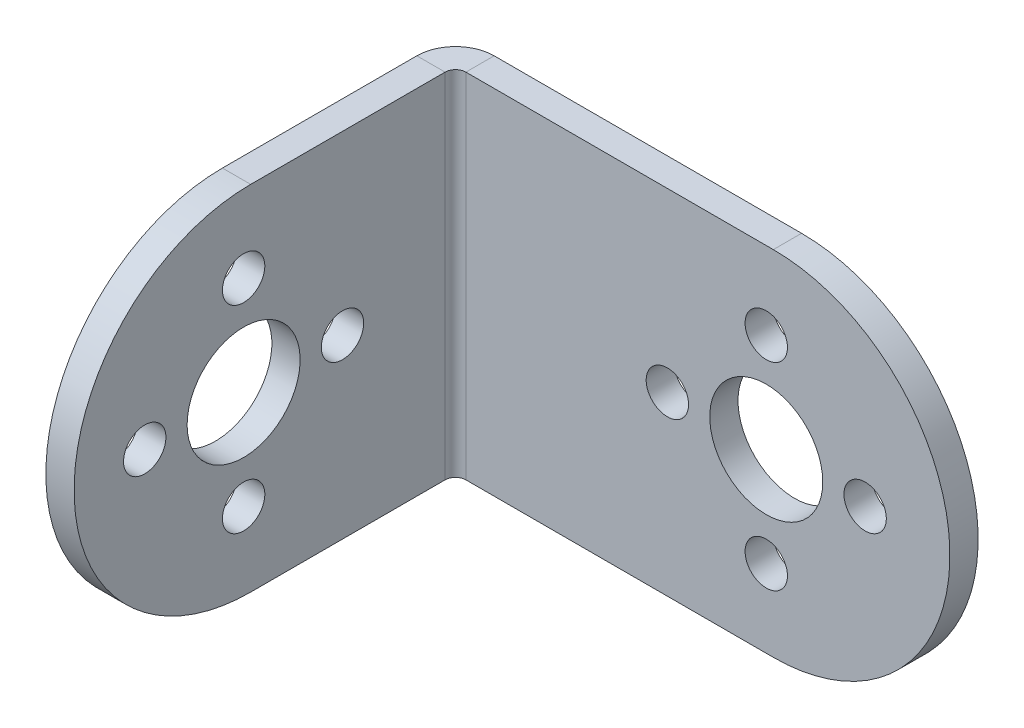
ISO-10303-21;
HEADER;
FILE_DESCRIPTION(('STEP AP214'),'2;1');
FILE_NAME('part.step','',(''),(''),'','','');
FILE_SCHEMA(('AUTOMOTIVE_DESIGN { 1 0 10303 214 1 1 1 1 }'));
ENDSEC;
DATA;
#1=APPLICATION_CONTEXT('core data for automotive mechanical design processes');
#2=APPLICATION_PROTOCOL_DEFINITION('international standard','automotive_design',2000,#1);
#3=PRODUCT_CONTEXT('',#1,'mechanical');
#4=PRODUCT('Part','Part','',(#3));
#5=PRODUCT_RELATED_PRODUCT_CATEGORY('part','',(#4));
#6=PRODUCT_DEFINITION_FORMATION('','',#4);
#7=PRODUCT_DEFINITION_CONTEXT('part definition',#1,'design');
#8=PRODUCT_DEFINITION('design','',#6,#7);
#9=PRODUCT_DEFINITION_SHAPE('','',#8);
#10=(LENGTH_UNIT() NAMED_UNIT(*) SI_UNIT(.MILLI.,.METRE.));
#11=(NAMED_UNIT(*) PLANE_ANGLE_UNIT() SI_UNIT($,.RADIAN.));
#12=(NAMED_UNIT(*) SI_UNIT($,.STERADIAN.) SOLID_ANGLE_UNIT());
#13=UNCERTAINTY_MEASURE_WITH_UNIT(LENGTH_MEASURE(1.E-05),#10,'distance_accuracy_value','');
#14=(GEOMETRIC_REPRESENTATION_CONTEXT(3) GLOBAL_UNCERTAINTY_ASSIGNED_CONTEXT((#13)) GLOBAL_UNIT_ASSIGNED_CONTEXT((#10,
#11,#12)) REPRESENTATION_CONTEXT('',''));
#15=CARTESIAN_POINT('',(0.,0.,0.));
#16=DIRECTION('',(0.,0.,1.));
#17=DIRECTION('',(1.,0.,0.));
#18=AXIS2_PLACEMENT_3D('',#15,#16,#17);
#19=CARTESIAN_POINT('',(0.,0.,0.));
#20=DIRECTION('',(-1.,0.,0.));
#21=DIRECTION('',(0.,0.,1.));
#22=AXIS2_PLACEMENT_3D('',#19,#20,#21);
#23=PLANE('',#22);
#24=CARTESIAN_POINT('',(0.,-5.5,15.));
#25=DIRECTION('',(-1.,0.,0.));
#26=DIRECTION('',(0.,0.,1.));
#27=AXIS2_PLACEMENT_3D('',#24,#25,#26);
#28=CIRCLE('',#27,1.5);
#29=CARTESIAN_POINT('',(0.,-5.5,16.5));
#30=VERTEX_POINT('',#29);
#31=EDGE_CURVE('E140',#30,#30,#28,.T.);
#32=ORIENTED_EDGE('',*,*,#31,.F.);
#33=EDGE_LOOP('',(#32));
#34=FACE_BOUND('',#33,.T.);
#35=CARTESIAN_POINT('',(0.,-12.5,7.99999999999999));
#36=DIRECTION('',(-1.,0.,0.));
#37=DIRECTION('',(0.,0.,1.));
#38=AXIS2_PLACEMENT_3D('',#35,#36,#37);
#39=CIRCLE('',#38,1.5);
#40=CARTESIAN_POINT('',(0.,-12.5,9.49999999999999));
#41=VERTEX_POINT('',#40);
#42=EDGE_CURVE('E439',#41,#41,#39,.T.);
#43=ORIENTED_EDGE('',*,*,#42,.F.);
#44=EDGE_LOOP('',(#43));
#45=FACE_BOUND('',#44,.T.);
#46=CARTESIAN_POINT('',(0.,-12.5,15.));
#47=DIRECTION('',(-1.,0.,0.));
#48=DIRECTION('',(0.,0.,1.));
#49=AXIS2_PLACEMENT_3D('',#46,#47,#48);
#50=CIRCLE('',#49,4.);
#51=CARTESIAN_POINT('',(0.,-12.5,19.));
#52=VERTEX_POINT('',#51);
#53=EDGE_CURVE('E152',#52,#52,#50,.T.);
#54=ORIENTED_EDGE('',*,*,#53,.F.);
#55=EDGE_LOOP('',(#54));
#56=FACE_BOUND('',#55,.T.);
#57=CARTESIAN_POINT('',(0.,-12.5,22.));
#58=DIRECTION('',(-1.,0.,0.));
#59=DIRECTION('',(0.,0.,1.));
#60=AXIS2_PLACEMENT_3D('',#57,#58,#59);
#61=CIRCLE('',#60,1.5);
#62=CARTESIAN_POINT('',(0.,-12.5,23.5));
#63=VERTEX_POINT('',#62);
#64=EDGE_CURVE('E445',#63,#63,#61,.T.);
#65=ORIENTED_EDGE('',*,*,#64,.F.);
#66=EDGE_LOOP('',(#65));
#67=FACE_BOUND('',#66,.T.);
#68=CARTESIAN_POINT('',(0.,-19.5,15.));
#69=DIRECTION('',(-1.,0.,0.));
#70=DIRECTION('',(0.,0.,1.));
#71=AXIS2_PLACEMENT_3D('',#68,#69,#70);
#72=CIRCLE('',#71,1.5);
#73=CARTESIAN_POINT('',(0.,-19.5,16.5));
#74=VERTEX_POINT('',#73);
#75=EDGE_CURVE('E432',#74,#74,#72,.T.);
#76=ORIENTED_EDGE('',*,*,#75,.F.);
#77=EDGE_LOOP('',(#76));
#78=FACE_BOUND('',#77,.T.);
#79=DIRECTION('',(0.,0.,-1.));
#80=VECTOR('',#79,1.);
#81=CARTESIAN_POINT('',(0.,-25.,0.));
#82=LINE('',#81,#80);
#83=CARTESIAN_POINT('',(0.,-25.,14.5));
#84=VERTEX_POINT('',#83);
#85=CARTESIAN_POINT('',(0.,-25.,0.73659999999999));
#86=VERTEX_POINT('',#85);
#87=EDGE_CURVE('E137',#84,#86,#82,.T.);
#88=ORIENTED_EDGE('',*,*,#87,.F.);
#89=CARTESIAN_POINT('',(0.,-12.5,14.5));
#90=DIRECTION('',(-1.,0.,0.));
#91=DIRECTION('',(0.,0.,1.));
#92=AXIS2_PLACEMENT_3D('',#89,#90,#91);
#93=CIRCLE('',#92,12.5);
#94=CARTESIAN_POINT('',(0.,0.,14.5));
#95=VERTEX_POINT('',#94);
#96=EDGE_CURVE('E123',#95,#84,#93,.F.);
#97=ORIENTED_EDGE('',*,*,#96,.F.);
#98=DIRECTION('',(0.,0.,1.));
#99=VECTOR('',#98,1.);
#100=CARTESIAN_POINT('',(0.,0.,28.));
#101=LINE('',#100,#99);
#102=CARTESIAN_POINT('',(0.,0.,0.73659999999999));
#103=VERTEX_POINT('',#102);
#104=EDGE_CURVE('E145',#103,#95,#101,.T.);
#105=ORIENTED_EDGE('',*,*,#104,.F.);
#106=DIRECTION('',(0.,-1.,0.));
#107=VECTOR('',#106,1.);
#108=CARTESIAN_POINT('',(0.,0.,0.73659999999999));
#109=LINE('',#108,#107);
#110=EDGE_CURVE('E143',#103,#86,#109,.T.);
#111=ORIENTED_EDGE('',*,*,#110,.T.);
#112=EDGE_LOOP('',(#88,#97,#105,#111));
#113=FACE_BOUND('',#112,.T.);
#114=ADVANCED_FACE('F61',(#34,#45,#56,#67,#78,#113),#23,.T.);
#115=CARTESIAN_POINT('',(2.,0.,0.));
#116=DIRECTION('',(-1.,0.,0.));
#117=DIRECTION('',(0.,0.,1.));
#118=AXIS2_PLACEMENT_3D('',#115,#116,#117);
#119=PLANE('',#118);
#120=CARTESIAN_POINT('',(1.99999999999995,-5.5,15.));
#121=DIRECTION('',(-1.,0.,0.));
#122=DIRECTION('',(0.,0.,1.));
#123=AXIS2_PLACEMENT_3D('',#120,#121,#122);
#124=CIRCLE('',#123,1.5);
#125=CARTESIAN_POINT('',(1.99999999999994,-5.5,16.5));
#126=VERTEX_POINT('',#125);
#127=EDGE_CURVE('E429',#126,#126,#124,.T.);
#128=ORIENTED_EDGE('',*,*,#127,.T.);
#129=EDGE_LOOP('',(#128));
#130=FACE_BOUND('',#129,.T.);
#131=CARTESIAN_POINT('',(1.99999999999997,-12.5,8.));
#132=DIRECTION('',(-1.,0.,0.));
#133=DIRECTION('',(0.,0.,1.));
#134=AXIS2_PLACEMENT_3D('',#131,#132,#133);
#135=CIRCLE('',#134,1.5);
#136=CARTESIAN_POINT('',(1.99999999999997,-12.5,9.5));
#137=VERTEX_POINT('',#136);
#138=EDGE_CURVE('E442',#137,#137,#135,.T.);
#139=ORIENTED_EDGE('',*,*,#138,.T.);
#140=EDGE_LOOP('',(#139));
#141=FACE_BOUND('',#140,.T.);
#142=CARTESIAN_POINT('',(1.99999999999995,-12.5,15.));
#143=DIRECTION('',(-1.,0.,0.));
#144=DIRECTION('',(0.,0.,1.));
#145=AXIS2_PLACEMENT_3D('',#142,#143,#144);
#146=CIRCLE('',#145,4.);
#147=CARTESIAN_POINT('',(1.99999999999993,-12.5,19.));
#148=VERTEX_POINT('',#147);
#149=EDGE_CURVE('E169',#148,#148,#146,.T.);
#150=ORIENTED_EDGE('',*,*,#149,.T.);
#151=EDGE_LOOP('',(#150));
#152=FACE_BOUND('',#151,.T.);
#153=CARTESIAN_POINT('',(1.99999999999992,-12.5,22.));
#154=DIRECTION('',(-1.,0.,0.));
#155=DIRECTION('',(0.,0.,1.));
#156=AXIS2_PLACEMENT_3D('',#153,#154,#155);
#157=CIRCLE('',#156,1.5);
#158=CARTESIAN_POINT('',(1.99999999999992,-12.5,23.5));
#159=VERTEX_POINT('',#158);
#160=EDGE_CURVE('E448',#159,#159,#157,.T.);
#161=ORIENTED_EDGE('',*,*,#160,.T.);
#162=EDGE_LOOP('',(#161));
#163=FACE_BOUND('',#162,.T.);
#164=CARTESIAN_POINT('',(1.99999999999995,-19.5,15.));
#165=DIRECTION('',(-1.,0.,0.));
#166=DIRECTION('',(0.,0.,1.));
#167=AXIS2_PLACEMENT_3D('',#164,#165,#166);
#168=CIRCLE('',#167,1.5);
#169=CARTESIAN_POINT('',(1.99999999999994,-19.5,16.5));
#170=VERTEX_POINT('',#169);
#171=EDGE_CURVE('E436',#170,#170,#168,.T.);
#172=ORIENTED_EDGE('',*,*,#171,.T.);
#173=EDGE_LOOP('',(#172));
#174=FACE_BOUND('',#173,.T.);
#175=CARTESIAN_POINT('',(1.99999999999995,-12.5,14.5));
#176=DIRECTION('',(-1.,0.,0.));
#177=DIRECTION('',(0.,0.,1.));
#178=AXIS2_PLACEMENT_3D('',#175,#176,#177);
#179=CIRCLE('',#178,12.5);
#180=CARTESIAN_POINT('',(1.99999999999995,0.,14.5));
#181=VERTEX_POINT('',#180);
#182=CARTESIAN_POINT('',(1.99999999999995,-25.,14.5));
#183=VERTEX_POINT('',#182);
#184=EDGE_CURVE('E76',#181,#183,#179,.F.);
#185=ORIENTED_EDGE('',*,*,#184,.T.);
#186=DIRECTION('',(0.,0.,1.));
#187=VECTOR('',#186,1.);
#188=CARTESIAN_POINT('',(2.,-25.,0.));
#189=LINE('',#188,#187);
#190=CARTESIAN_POINT('',(2.,-25.,0.736599999999997));
#191=VERTEX_POINT('',#190);
#192=EDGE_CURVE('E139',#183,#191,#189,.F.);
#193=ORIENTED_EDGE('',*,*,#192,.T.);
#194=DIRECTION('',(0.,1.,0.));
#195=VECTOR('',#194,1.);
#196=CARTESIAN_POINT('',(2.,0.,0.736599999999997));
#197=LINE('',#196,#195);
#198=CARTESIAN_POINT('',(2.,0.,0.736599999999997));
#199=VERTEX_POINT('',#198);
#200=EDGE_CURVE('E163',#199,#191,#197,.F.);
#201=ORIENTED_EDGE('',*,*,#200,.F.);
#202=DIRECTION('',(0.,0.,-1.));
#203=VECTOR('',#202,1.);
#204=CARTESIAN_POINT('',(2.,0.,0.));
#205=LINE('',#204,#203);
#206=EDGE_CURVE('E156',#199,#181,#205,.F.);
#207=ORIENTED_EDGE('',*,*,#206,.T.);
#208=EDGE_LOOP('',(#185,#193,#201,#207));
#209=FACE_BOUND('',#208,.T.);
#210=ADVANCED_FACE('F265',(#130,#141,#152,#163,#174,#209),#119,.F.);
#211=CARTESIAN_POINT('',(0.,-25.,0.));
#212=DIRECTION('',(0.,-1.,0.));
#213=DIRECTION('',(0.,0.,-1.));
#214=AXIS2_PLACEMENT_3D('',#211,#212,#213);
#215=PLANE('',#214);
#216=ORIENTED_EDGE('',*,*,#192,.F.);
#217=DIRECTION('',(1.,0.,0.));
#218=VECTOR('',#217,1.);
#219=CARTESIAN_POINT('',(1.99999999999995,-25.,14.5));
#220=LINE('',#219,#218);
#221=EDGE_CURVE('E126',#183,#84,#220,.F.);
#222=ORIENTED_EDGE('',*,*,#221,.T.);
#223=ORIENTED_EDGE('',*,*,#87,.T.);
#224=DIRECTION('',(-1.,0.,0.));
#225=VECTOR('',#224,1.);
#226=CARTESIAN_POINT('',(2.,-25.,0.736599999999997));
#227=LINE('',#226,#225);
#228=EDGE_CURVE('E160',#191,#86,#227,.T.);
#229=ORIENTED_EDGE('',*,*,#228,.F.);
#230=EDGE_LOOP('',(#216,#222,#223,#229));
#231=FACE_BOUND('',#230,.T.);
#232=ADVANCED_FACE('F135',(#231),#215,.T.);
#233=CARTESIAN_POINT('',(0.,-25.,-2.));
#234=DIRECTION('',(0.,-1.,0.));
#235=DIRECTION('',(1.,0.,0.));
#236=AXIS2_PLACEMENT_3D('',#233,#234,#235);
#237=PLANE('',#236);
#238=DIRECTION('',(1.,0.,0.));
#239=VECTOR('',#238,1.);
#240=CARTESIAN_POINT('',(0.,-25.,0.));
#241=LINE('',#240,#239);
#242=CARTESIAN_POINT('',(2.7366,-25.,0.));
#243=VERTEX_POINT('',#242);
#244=CARTESIAN_POINT('',(24.5,-25.,0.));
#245=VERTEX_POINT('',#244);
#246=EDGE_CURVE('E228',#243,#245,#241,.T.);
#247=ORIENTED_EDGE('',*,*,#246,.F.);
#248=DIRECTION('',(0.,0.,-1.));
#249=VECTOR('',#248,1.);
#250=CARTESIAN_POINT('',(2.7366,-25.,0.));
#251=LINE('',#250,#249);
#252=CARTESIAN_POINT('',(2.7366,-25.,-2.));
#253=VERTEX_POINT('',#252);
#254=EDGE_CURVE('E175',#243,#253,#251,.T.);
#255=ORIENTED_EDGE('',*,*,#254,.T.);
#256=DIRECTION('',(1.,0.,0.));
#257=VECTOR('',#256,1.);
#258=CARTESIAN_POINT('',(0.,-25.,-2.));
#259=LINE('',#258,#257);
#260=CARTESIAN_POINT('',(24.5,-25.,-2.));
#261=VERTEX_POINT('',#260);
#262=EDGE_CURVE('E220',#253,#261,#259,.T.);
#263=ORIENTED_EDGE('',*,*,#262,.T.);
#264=DIRECTION('',(0.,0.,1.));
#265=VECTOR('',#264,1.);
#266=CARTESIAN_POINT('',(24.5,-25.,-2.));
#267=LINE('',#266,#265);
#268=EDGE_CURVE('E65',#261,#245,#267,.T.);
#269=ORIENTED_EDGE('',*,*,#268,.T.);
#270=EDGE_LOOP('',(#247,#255,#263,#269));
#271=FACE_BOUND('',#270,.T.);
#272=ADVANCED_FACE('F256',(#271),#237,.T.);
#273=CARTESIAN_POINT('',(24.5,-12.5,-2.));
#274=DIRECTION('',(0.,0.,-1.));
#275=DIRECTION('',(-1.,0.,0.));
#276=AXIS2_PLACEMENT_3D('',#273,#274,#275);
#277=PLANE('',#276);
#278=CARTESIAN_POINT('',(24.,-12.5,-2.));
#279=DIRECTION('',(0.,0.,1.));
#280=DIRECTION('',(1.,0.,0.));
#281=AXIS2_PLACEMENT_3D('',#278,#279,#280);
#282=CIRCLE('',#281,4.);
#283=CARTESIAN_POINT('',(28.,-12.5,-2.));
#284=VERTEX_POINT('',#283);
#285=EDGE_CURVE('E211',#284,#284,#282,.T.);
#286=ORIENTED_EDGE('',*,*,#285,.T.);
#287=EDGE_LOOP('',(#286));
#288=FACE_BOUND('',#287,.T.);
#289=CARTESIAN_POINT('',(17.,-12.5,-2.));
#290=DIRECTION('',(0.,0.,1.));
#291=DIRECTION('',(1.,0.,0.));
#292=AXIS2_PLACEMENT_3D('',#289,#290,#291);
#293=CIRCLE('',#292,1.5);
#294=CARTESIAN_POINT('',(18.5,-12.5,-2.));
#295=VERTEX_POINT('',#294);
#296=EDGE_CURVE('E205',#295,#295,#293,.T.);
#297=ORIENTED_EDGE('',*,*,#296,.T.);
#298=EDGE_LOOP('',(#297));
#299=FACE_BOUND('',#298,.T.);
#300=CARTESIAN_POINT('',(31.,-12.5,-2.));
#301=DIRECTION('',(0.,0.,1.));
#302=DIRECTION('',(1.,0.,0.));
#303=AXIS2_PLACEMENT_3D('',#300,#301,#302);
#304=CIRCLE('',#303,1.5);
#305=CARTESIAN_POINT('',(32.5,-12.5,-2.));
#306=VERTEX_POINT('',#305);
#307=EDGE_CURVE('E199',#306,#306,#304,.T.);
#308=ORIENTED_EDGE('',*,*,#307,.T.);
#309=EDGE_LOOP('',(#308));
#310=FACE_BOUND('',#309,.T.);
#311=CARTESIAN_POINT('',(24.,-19.5,-2.));
#312=DIRECTION('',(0.,0.,1.));
#313=DIRECTION('',(1.,0.,0.));
#314=AXIS2_PLACEMENT_3D('',#311,#312,#313);
#315=CIRCLE('',#314,1.5);
#316=CARTESIAN_POINT('',(25.5,-19.5,-2.));
#317=VERTEX_POINT('',#316);
#318=EDGE_CURVE('E193',#317,#317,#315,.T.);
#319=ORIENTED_EDGE('',*,*,#318,.T.);
#320=EDGE_LOOP('',(#319));
#321=FACE_BOUND('',#320,.T.);
#322=CARTESIAN_POINT('',(24.,-5.5,-2.));
#323=DIRECTION('',(0.,0.,1.));
#324=DIRECTION('',(1.,0.,0.));
#325=AXIS2_PLACEMENT_3D('',#322,#323,#324);
#326=CIRCLE('',#325,1.5);
#327=CARTESIAN_POINT('',(25.5,-5.5,-2.));
#328=VERTEX_POINT('',#327);
#329=EDGE_CURVE('E187',#328,#328,#326,.T.);
#330=ORIENTED_EDGE('',*,*,#329,.T.);
#331=EDGE_LOOP('',(#330));
#332=FACE_BOUND('',#331,.T.);
#333=ORIENTED_EDGE('',*,*,#262,.F.);
#334=DIRECTION('',(0.,-1.,0.));
#335=VECTOR('',#334,1.);
#336=CARTESIAN_POINT('',(2.7366,-25.,-2.));
#337=LINE('',#336,#335);
#338=CARTESIAN_POINT('',(2.7366,0.,-2.));
#339=VERTEX_POINT('',#338);
#340=EDGE_CURVE('E170',#253,#339,#337,.F.);
#341=ORIENTED_EDGE('',*,*,#340,.T.);
#342=DIRECTION('',(-1.,0.,0.));
#343=VECTOR('',#342,1.);
#344=CARTESIAN_POINT('',(0.,0.,-2.));
#345=LINE('',#344,#343);
#346=CARTESIAN_POINT('',(24.5,0.,-2.));
#347=VERTEX_POINT('',#346);
#348=EDGE_CURVE('E217',#347,#339,#345,.T.);
#349=ORIENTED_EDGE('',*,*,#348,.F.);
#350=CARTESIAN_POINT('',(24.5,-12.5,-2.));
#351=DIRECTION('',(0.,0.,1.));
#352=DIRECTION('',(-1.,0.,0.));
#353=AXIS2_PLACEMENT_3D('',#350,#351,#352);
#354=CIRCLE('',#353,12.5);
#355=EDGE_CURVE('E223',#261,#347,#354,.T.);
#356=ORIENTED_EDGE('',*,*,#355,.F.);
#357=EDGE_LOOP('',(#333,#341,#349,#356));
#358=FACE_BOUND('',#357,.T.);
#359=ADVANCED_FACE('F250',(#288,#299,#310,#321,#332,#358),#277,.T.);
#360=CARTESIAN_POINT('',(24.5,-12.5,0.));
#361=DIRECTION('',(0.,0.,-1.));
#362=DIRECTION('',(-1.,0.,0.));
#363=AXIS2_PLACEMENT_3D('',#360,#361,#362);
#364=PLANE('',#363);
#365=CARTESIAN_POINT('',(24.,-12.5,0.));
#366=DIRECTION('',(0.,0.,1.));
#367=DIRECTION('',(1.,0.,0.));
#368=AXIS2_PLACEMENT_3D('',#365,#366,#367);
#369=CIRCLE('',#368,4.);
#370=CARTESIAN_POINT('',(28.,-12.5,0.));
#371=VERTEX_POINT('',#370);
#372=EDGE_CURVE('E208',#371,#371,#369,.T.);
#373=ORIENTED_EDGE('',*,*,#372,.F.);
#374=EDGE_LOOP('',(#373));
#375=FACE_BOUND('',#374,.T.);
#376=CARTESIAN_POINT('',(17.,-12.5,0.));
#377=DIRECTION('',(0.,0.,1.));
#378=DIRECTION('',(1.,0.,0.));
#379=AXIS2_PLACEMENT_3D('',#376,#377,#378);
#380=CIRCLE('',#379,1.5);
#381=CARTESIAN_POINT('',(18.5,-12.5,0.));
#382=VERTEX_POINT('',#381);
#383=EDGE_CURVE('E202',#382,#382,#380,.T.);
#384=ORIENTED_EDGE('',*,*,#383,.F.);
#385=EDGE_LOOP('',(#384));
#386=FACE_BOUND('',#385,.T.);
#387=CARTESIAN_POINT('',(31.,-12.5,0.));
#388=DIRECTION('',(0.,0.,1.));
#389=DIRECTION('',(1.,0.,0.));
#390=AXIS2_PLACEMENT_3D('',#387,#388,#389);
#391=CIRCLE('',#390,1.5);
#392=CARTESIAN_POINT('',(32.5,-12.5,0.));
#393=VERTEX_POINT('',#392);
#394=EDGE_CURVE('E196',#393,#393,#391,.T.);
#395=ORIENTED_EDGE('',*,*,#394,.F.);
#396=EDGE_LOOP('',(#395));
#397=FACE_BOUND('',#396,.T.);
#398=CARTESIAN_POINT('',(24.,-19.5,0.));
#399=DIRECTION('',(0.,0.,1.));
#400=DIRECTION('',(1.,0.,0.));
#401=AXIS2_PLACEMENT_3D('',#398,#399,#400);
#402=CIRCLE('',#401,1.5);
#403=CARTESIAN_POINT('',(25.5,-19.5,0.));
#404=VERTEX_POINT('',#403);
#405=EDGE_CURVE('E190',#404,#404,#402,.T.);
#406=ORIENTED_EDGE('',*,*,#405,.F.);
#407=EDGE_LOOP('',(#406));
#408=FACE_BOUND('',#407,.T.);
#409=CARTESIAN_POINT('',(24.,-5.5,0.));
#410=DIRECTION('',(0.,0.,1.));
#411=DIRECTION('',(1.,0.,0.));
#412=AXIS2_PLACEMENT_3D('',#409,#410,#411);
#413=CIRCLE('',#412,1.5);
#414=CARTESIAN_POINT('',(25.5,-5.5,0.));
#415=VERTEX_POINT('',#414);
#416=EDGE_CURVE('E184',#415,#415,#413,.T.);
#417=ORIENTED_EDGE('',*,*,#416,.F.);
#418=EDGE_LOOP('',(#417));
#419=FACE_BOUND('',#418,.T.);
#420=DIRECTION('',(0.,-1.,0.));
#421=VECTOR('',#420,1.);
#422=CARTESIAN_POINT('',(2.7366,-25.,0.));
#423=LINE('',#422,#421);
#424=CARTESIAN_POINT('',(2.7366,0.,0.));
#425=VERTEX_POINT('',#424);
#426=EDGE_CURVE('E148',#243,#425,#423,.F.);
#427=ORIENTED_EDGE('',*,*,#426,.F.);
#428=ORIENTED_EDGE('',*,*,#246,.T.);
#429=CARTESIAN_POINT('',(24.5,-12.5,0.));
#430=DIRECTION('',(0.,0.,1.));
#431=DIRECTION('',(-1.,0.,0.));
#432=AXIS2_PLACEMENT_3D('',#429,#430,#431);
#433=CIRCLE('',#432,12.5);
#434=CARTESIAN_POINT('',(24.5,0.,0.));
#435=VERTEX_POINT('',#434);
#436=EDGE_CURVE('E221',#245,#435,#433,.T.);
#437=ORIENTED_EDGE('',*,*,#436,.T.);
#438=DIRECTION('',(-1.,0.,0.));
#439=VECTOR('',#438,1.);
#440=CARTESIAN_POINT('',(0.,0.,0.));
#441=LINE('',#440,#439);
#442=EDGE_CURVE('E214',#435,#425,#441,.T.);
#443=ORIENTED_EDGE('',*,*,#442,.T.);
#444=EDGE_LOOP('',(#427,#428,#437,#443));
#445=FACE_BOUND('',#444,.T.);
#446=ADVANCED_FACE('F234',(#375,#386,#397,#408,#419,#445),#364,.F.);
#447=CARTESIAN_POINT('',(0.,0.,-2.));
#448=DIRECTION('',(0.,1.,0.));
#449=DIRECTION('',(0.,0.,1.));
#450=AXIS2_PLACEMENT_3D('',#447,#448,#449);
#451=PLANE('',#450);
#452=DIRECTION('',(0.,0.,-1.));
#453=VECTOR('',#452,1.);
#454=CARTESIAN_POINT('',(2.7366,0.,0.));
#455=LINE('',#454,#453);
#456=EDGE_CURVE('E182',#425,#339,#455,.T.);
#457=ORIENTED_EDGE('',*,*,#456,.F.);
#458=ORIENTED_EDGE('',*,*,#442,.F.);
#459=DIRECTION('',(0.,0.,1.));
#460=VECTOR('',#459,1.);
#461=CARTESIAN_POINT('',(24.5,0.,-2.));
#462=LINE('',#461,#460);
#463=EDGE_CURVE('E13',#347,#435,#462,.T.);
#464=ORIENTED_EDGE('',*,*,#463,.F.);
#465=ORIENTED_EDGE('',*,*,#348,.T.);
#466=EDGE_LOOP('',(#457,#458,#464,#465));
#467=FACE_BOUND('',#466,.T.);
#468=ADVANCED_FACE('F63',(#467),#451,.T.);
#469=CARTESIAN_POINT('',(24.5,-12.5,-2.));
#470=DIRECTION('',(0.,0.,1.));
#471=DIRECTION('',(1.,0.,0.));
#472=AXIS2_PLACEMENT_3D('',#469,#470,#471);
#473=CYLINDRICAL_SURFACE('',#472,12.5);
#474=ORIENTED_EDGE('',*,*,#436,.F.);
#475=ORIENTED_EDGE('',*,*,#268,.F.);
#476=ORIENTED_EDGE('',*,*,#355,.T.);
#477=ORIENTED_EDGE('',*,*,#463,.T.);
#478=EDGE_LOOP('',(#474,#475,#476,#477));
#479=FACE_BOUND('',#478,.T.);
#480=ADVANCED_FACE('F241',(#479),#473,.T.);
#481=CARTESIAN_POINT('',(24.,-12.5,-2.));
#482=DIRECTION('',(0.,0.,1.));
#483=DIRECTION('',(1.,0.,0.));
#484=AXIS2_PLACEMENT_3D('',#481,#482,#483);
#485=CYLINDRICAL_SURFACE('',#484,4.);
#486=ORIENTED_EDGE('',*,*,#285,.F.);
#487=EDGE_LOOP('',(#486));
#488=FACE_BOUND('',#487,.T.);
#489=ORIENTED_EDGE('',*,*,#372,.T.);
#490=EDGE_LOOP('',(#489));
#491=FACE_BOUND('',#490,.T.);
#492=ADVANCED_FACE('F310',(#488,#491),#485,.F.);
#493=CARTESIAN_POINT('',(17.,-12.5,-2.));
#494=DIRECTION('',(0.,0.,1.));
#495=DIRECTION('',(1.,0.,0.));
#496=AXIS2_PLACEMENT_3D('',#493,#494,#495);
#497=CYLINDRICAL_SURFACE('',#496,1.5);
#498=ORIENTED_EDGE('',*,*,#296,.F.);
#499=EDGE_LOOP('',(#498));
#500=FACE_BOUND('',#499,.T.);
#501=ORIENTED_EDGE('',*,*,#383,.T.);
#502=EDGE_LOOP('',(#501));
#503=FACE_BOUND('',#502,.T.);
#504=ADVANCED_FACE('F306',(#500,#503),#497,.F.);
#505=CARTESIAN_POINT('',(31.,-12.5,-2.));
#506=DIRECTION('',(0.,0.,1.));
#507=DIRECTION('',(1.,0.,0.));
#508=AXIS2_PLACEMENT_3D('',#505,#506,#507);
#509=CYLINDRICAL_SURFACE('',#508,1.5);
#510=ORIENTED_EDGE('',*,*,#307,.F.);
#511=EDGE_LOOP('',(#510));
#512=FACE_BOUND('',#511,.T.);
#513=ORIENTED_EDGE('',*,*,#394,.T.);
#514=EDGE_LOOP('',(#513));
#515=FACE_BOUND('',#514,.T.);
#516=ADVANCED_FACE('F302',(#512,#515),#509,.F.);
#517=CARTESIAN_POINT('',(24.,-19.5,-2.));
#518=DIRECTION('',(0.,0.,1.));
#519=DIRECTION('',(1.,0.,0.));
#520=AXIS2_PLACEMENT_3D('',#517,#518,#519);
#521=CYLINDRICAL_SURFACE('',#520,1.5);
#522=ORIENTED_EDGE('',*,*,#318,.F.);
#523=EDGE_LOOP('',(#522));
#524=FACE_BOUND('',#523,.T.);
#525=ORIENTED_EDGE('',*,*,#405,.T.);
#526=EDGE_LOOP('',(#525));
#527=FACE_BOUND('',#526,.T.);
#528=ADVANCED_FACE('F298',(#524,#527),#521,.F.);
#529=CARTESIAN_POINT('',(24.,-5.5,-2.));
#530=DIRECTION('',(0.,0.,1.));
#531=DIRECTION('',(1.,0.,0.));
#532=AXIS2_PLACEMENT_3D('',#529,#530,#531);
#533=CYLINDRICAL_SURFACE('',#532,1.5);
#534=ORIENTED_EDGE('',*,*,#329,.F.);
#535=EDGE_LOOP('',(#534));
#536=FACE_BOUND('',#535,.T.);
#537=ORIENTED_EDGE('',*,*,#416,.T.);
#538=EDGE_LOOP('',(#537));
#539=FACE_BOUND('',#538,.T.);
#540=ADVANCED_FACE('F294',(#536,#539),#533,.F.);
#541=CARTESIAN_POINT('',(2.7366,0.,0.7366));
#542=DIRECTION('',(0.,1.,0.));
#543=DIRECTION('',(0.,0.,1.));
#544=AXIS2_PLACEMENT_3D('',#541,#542,#543);
#545=PLANE('',#544);
#546=DIRECTION('',(-1.,0.,0.));
#547=VECTOR('',#546,1.);
#548=CARTESIAN_POINT('',(0.,0.,0.73659999999999));
#549=LINE('',#548,#547);
#550=EDGE_CURVE('E166',#199,#103,#549,.T.);
#551=ORIENTED_EDGE('',*,*,#550,.F.);
#552=CARTESIAN_POINT('',(2.7366,0.,0.7366));
#553=DIRECTION('',(0.,-1.,0.));
#554=DIRECTION('',(0.,0.,-1.));
#555=AXIS2_PLACEMENT_3D('',#552,#553,#554);
#556=CIRCLE('',#555,0.7366);
#557=EDGE_CURVE('E178',#425,#199,#556,.F.);
#558=ORIENTED_EDGE('',*,*,#557,.F.);
#559=ORIENTED_EDGE('',*,*,#456,.T.);
#560=CARTESIAN_POINT('',(2.7366,0.,0.7366));
#561=DIRECTION('',(0.,-1.,0.));
#562=DIRECTION('',(0.,0.,-1.));
#563=AXIS2_PLACEMENT_3D('',#560,#561,#562);
#564=CIRCLE('',#563,2.7366);
#565=EDGE_CURVE('E84',#339,#103,#564,.F.);
#566=ORIENTED_EDGE('',*,*,#565,.T.);
#567=EDGE_LOOP('',(#551,#558,#559,#566));
#568=FACE_BOUND('',#567,.T.);
#569=ADVANCED_FACE('F247',(#568),#545,.T.);
#570=CARTESIAN_POINT('',(2.7366,-25.,0.7366));
#571=DIRECTION('',(0.,1.,0.));
#572=DIRECTION('',(0.,0.,1.));
#573=AXIS2_PLACEMENT_3D('',#570,#571,#572);
#574=PLANE('',#573);
#575=CARTESIAN_POINT('',(2.7366,-25.,0.7366));
#576=DIRECTION('',(0.,-1.,0.));
#577=DIRECTION('',(0.,0.,-1.));
#578=AXIS2_PLACEMENT_3D('',#575,#576,#577);
#579=CIRCLE('',#578,0.7366);
#580=EDGE_CURVE('E144',#191,#243,#579,.T.);
#581=ORIENTED_EDGE('',*,*,#580,.F.);
#582=ORIENTED_EDGE('',*,*,#228,.T.);
#583=CARTESIAN_POINT('',(2.7366,-25.,0.7366));
#584=DIRECTION('',(0.,-1.,0.));
#585=DIRECTION('',(0.,0.,-1.));
#586=AXIS2_PLACEMENT_3D('',#583,#584,#585);
#587=CIRCLE('',#586,2.7366);
#588=EDGE_CURVE('E173',#86,#253,#587,.T.);
#589=ORIENTED_EDGE('',*,*,#588,.T.);
#590=ORIENTED_EDGE('',*,*,#254,.F.);
#591=EDGE_LOOP('',(#581,#582,#589,#590));
#592=FACE_BOUND('',#591,.T.);
#593=ADVANCED_FACE('F254',(#592),#574,.F.);
#594=CARTESIAN_POINT('',(2.7366,-25.,0.7366));
#595=DIRECTION('',(0.,-1.,0.));
#596=DIRECTION('',(-1.,0.,0.));
#597=AXIS2_PLACEMENT_3D('',#594,#595,#596);
#598=CYLINDRICAL_SURFACE('',#597,2.7366);
#599=ORIENTED_EDGE('',*,*,#340,.F.);
#600=ORIENTED_EDGE('',*,*,#588,.F.);
#601=ORIENTED_EDGE('',*,*,#110,.F.);
#602=ORIENTED_EDGE('',*,*,#565,.F.);
#603=EDGE_LOOP('',(#599,#600,#601,#602));
#604=FACE_BOUND('',#603,.T.);
#605=ADVANCED_FACE('F251',(#604),#598,.T.);
#606=CARTESIAN_POINT('',(2.7366,-25.,0.7366));
#607=DIRECTION('',(0.,-1.,0.));
#608=DIRECTION('',(-1.,0.,0.));
#609=AXIS2_PLACEMENT_3D('',#606,#607,#608);
#610=CYLINDRICAL_SURFACE('',#609,0.7366);
#611=ORIENTED_EDGE('',*,*,#426,.T.);
#612=ORIENTED_EDGE('',*,*,#557,.T.);
#613=ORIENTED_EDGE('',*,*,#200,.T.);
#614=ORIENTED_EDGE('',*,*,#580,.T.);
#615=EDGE_LOOP('',(#611,#612,#613,#614));
#616=FACE_BOUND('',#615,.T.);
#617=ADVANCED_FACE('F286',(#616),#610,.F.);
#618=CARTESIAN_POINT('',(0.,0.,28.));
#619=DIRECTION('',(0.,1.,0.));
#620=DIRECTION('',(0.,0.,1.));
#621=AXIS2_PLACEMENT_3D('',#618,#619,#620);
#622=PLANE('',#621);
#623=DIRECTION('',(1.,0.,0.));
#624=VECTOR('',#623,1.);
#625=CARTESIAN_POINT('',(1.99999999999995,0.,14.5));
#626=LINE('',#625,#624);
#627=EDGE_CURVE('E127',#181,#95,#626,.F.);
#628=ORIENTED_EDGE('',*,*,#627,.F.);
#629=ORIENTED_EDGE('',*,*,#206,.F.);
#630=ORIENTED_EDGE('',*,*,#550,.T.);
#631=ORIENTED_EDGE('',*,*,#104,.T.);
#632=EDGE_LOOP('',(#628,#629,#630,#631));
#633=FACE_BOUND('',#632,.T.);
#634=ADVANCED_FACE('F283',(#633),#622,.T.);
#635=CARTESIAN_POINT('',(0.,-12.5,15.));
#636=DIRECTION('',(-1.,0.,0.));
#637=DIRECTION('',(0.,0.,1.));
#638=AXIS2_PLACEMENT_3D('',#635,#636,#637);
#639=CYLINDRICAL_SURFACE('',#638,4.);
#640=ORIENTED_EDGE('',*,*,#149,.F.);
#641=EDGE_LOOP('',(#640));
#642=FACE_BOUND('',#641,.T.);
#643=ORIENTED_EDGE('',*,*,#53,.T.);
#644=EDGE_LOOP('',(#643));
#645=FACE_BOUND('',#644,.T.);
#646=ADVANCED_FACE('F280',(#642,#645),#639,.F.);
#647=CARTESIAN_POINT('',(0.,-12.5,22.));
#648=DIRECTION('',(-1.,0.,0.));
#649=DIRECTION('',(0.,0.,1.));
#650=AXIS2_PLACEMENT_3D('',#647,#648,#649);
#651=CYLINDRICAL_SURFACE('',#650,1.5);
#652=ORIENTED_EDGE('',*,*,#160,.F.);
#653=EDGE_LOOP('',(#652));
#654=FACE_BOUND('',#653,.T.);
#655=ORIENTED_EDGE('',*,*,#64,.T.);
#656=EDGE_LOOP('',(#655));
#657=FACE_BOUND('',#656,.T.);
#658=ADVANCED_FACE('F377',(#654,#657),#651,.F.);
#659=CARTESIAN_POINT('',(0.,-12.5,7.99999999999999));
#660=DIRECTION('',(-1.,0.,0.));
#661=DIRECTION('',(0.,0.,1.));
#662=AXIS2_PLACEMENT_3D('',#659,#660,#661);
#663=CYLINDRICAL_SURFACE('',#662,1.5);
#664=ORIENTED_EDGE('',*,*,#138,.F.);
#665=EDGE_LOOP('',(#664));
#666=FACE_BOUND('',#665,.T.);
#667=ORIENTED_EDGE('',*,*,#42,.T.);
#668=EDGE_LOOP('',(#667));
#669=FACE_BOUND('',#668,.T.);
#670=ADVANCED_FACE('F386',(#666,#669),#663,.F.);
#671=CARTESIAN_POINT('',(0.,-19.5,15.));
#672=DIRECTION('',(-1.,0.,0.));
#673=DIRECTION('',(0.,0.,1.));
#674=AXIS2_PLACEMENT_3D('',#671,#672,#673);
#675=CYLINDRICAL_SURFACE('',#674,1.5);
#676=ORIENTED_EDGE('',*,*,#171,.F.);
#677=EDGE_LOOP('',(#676));
#678=FACE_BOUND('',#677,.T.);
#679=ORIENTED_EDGE('',*,*,#75,.T.);
#680=EDGE_LOOP('',(#679));
#681=FACE_BOUND('',#680,.T.);
#682=ADVANCED_FACE('F395',(#678,#681),#675,.F.);
#683=CARTESIAN_POINT('',(0.,-5.5,15.));
#684=DIRECTION('',(-1.,0.,0.));
#685=DIRECTION('',(0.,0.,1.));
#686=AXIS2_PLACEMENT_3D('',#683,#684,#685);
#687=CYLINDRICAL_SURFACE('',#686,1.5);
#688=ORIENTED_EDGE('',*,*,#127,.F.);
#689=EDGE_LOOP('',(#688));
#690=FACE_BOUND('',#689,.T.);
#691=ORIENTED_EDGE('',*,*,#31,.T.);
#692=EDGE_LOOP('',(#691));
#693=FACE_BOUND('',#692,.T.);
#694=ADVANCED_FACE('F405',(#690,#693),#687,.F.);
#695=CARTESIAN_POINT('',(1.99999999999995,-12.5,14.5));
#696=DIRECTION('',(-1.,0.,0.));
#697=DIRECTION('',(0.,0.,1.));
#698=AXIS2_PLACEMENT_3D('',#695,#696,#697);
#699=CYLINDRICAL_SURFACE('',#698,12.5);
#700=ORIENTED_EDGE('',*,*,#221,.F.);
#701=ORIENTED_EDGE('',*,*,#184,.F.);
#702=ORIENTED_EDGE('',*,*,#627,.T.);
#703=ORIENTED_EDGE('',*,*,#96,.T.);
#704=EDGE_LOOP('',(#700,#701,#702,#703));
#705=FACE_BOUND('',#704,.T.);
#706=ADVANCED_FACE('F125',(#705),#699,.T.);
#707=CLOSED_SHELL('',(#114,#210,#232,#272,#359,#446,#468,#480,#492,#504,#516,#528,#540,#569,
#593,#605,#617,#634,#646,#658,#670,#682,#694,#706));
#708=MANIFOLD_SOLID_BREP('B2',#707);
#709=ADVANCED_BREP_SHAPE_REPRESENTATION('',(#18,#708),#14);
#710=SHAPE_DEFINITION_REPRESENTATION(#9,#709);
ENDSEC;
END-ISO-10303-21;
